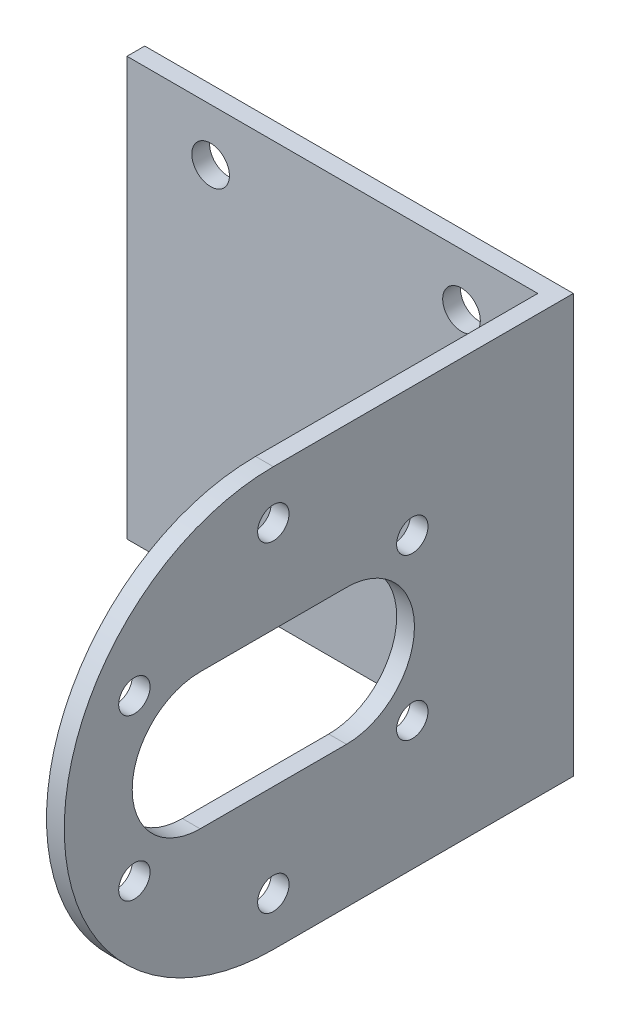
ISO-10303-21;
HEADER;
FILE_DESCRIPTION(('STEP AP214'),'2;1');
FILE_NAME('part.step','',(''),(''),'','','');
FILE_SCHEMA(('AUTOMOTIVE_DESIGN { 1 0 10303 214 1 1 1 1 }'));
ENDSEC;
DATA;
#1=APPLICATION_CONTEXT('core data for automotive mechanical design processes');
#2=APPLICATION_PROTOCOL_DEFINITION('international standard','automotive_design',2000,#1);
#3=PRODUCT_CONTEXT('',#1,'mechanical');
#4=PRODUCT('Part','Part','',(#3));
#5=PRODUCT_RELATED_PRODUCT_CATEGORY('part','',(#4));
#6=PRODUCT_DEFINITION_FORMATION('','',#4);
#7=PRODUCT_DEFINITION_CONTEXT('part definition',#1,'design');
#8=PRODUCT_DEFINITION('design','',#6,#7);
#9=PRODUCT_DEFINITION_SHAPE('','',#8);
#10=(LENGTH_UNIT() NAMED_UNIT(*) SI_UNIT(.MILLI.,.METRE.));
#11=(NAMED_UNIT(*) PLANE_ANGLE_UNIT() SI_UNIT($,.RADIAN.));
#12=(NAMED_UNIT(*) SI_UNIT($,.STERADIAN.) SOLID_ANGLE_UNIT());
#13=UNCERTAINTY_MEASURE_WITH_UNIT(LENGTH_MEASURE(1.E-05),#10,'distance_accuracy_value','');
#14=(GEOMETRIC_REPRESENTATION_CONTEXT(3) GLOBAL_UNCERTAINTY_ASSIGNED_CONTEXT((#13)) GLOBAL_UNIT_ASSIGNED_CONTEXT((#10,
#11,#12)) REPRESENTATION_CONTEXT('',''));
#15=CARTESIAN_POINT('',(0.,0.,0.));
#16=DIRECTION('',(0.,0.,1.));
#17=DIRECTION('',(1.,0.,0.));
#18=AXIS2_PLACEMENT_3D('',#15,#16,#17);
#19=CARTESIAN_POINT('',(41.,0.,1.7));
#20=DIRECTION('',(-1.,0.,0.));
#21=DIRECTION('',(0.,0.,1.));
#22=AXIS2_PLACEMENT_3D('',#19,#20,#21);
#23=PLANE('',#22);
#24=CARTESIAN_POINT('',(41.,12.3250000000001,15.4065100519088));
#25=DIRECTION('',(-1.,0.,0.));
#26=DIRECTION('',(0.,0.,1.));
#27=AXIS2_PLACEMENT_3D('',#24,#25,#26);
#28=CIRCLE('',#27,1.5);
#29=CARTESIAN_POINT('',(41.,12.3250000000001,16.9065100519088));
#30=VERTEX_POINT('',#29);
#31=EDGE_CURVE('E408',#30,#30,#28,.T.);
#32=ORIENTED_EDGE('',*,*,#31,.T.);
#33=EDGE_LOOP('',(#32));
#34=FACE_BOUND('',#33,.T.);
#35=CARTESIAN_POINT('',(41.,4.65,28.7));
#36=DIRECTION('',(-1.,0.,0.));
#37=DIRECTION('',(0.,0.,1.));
#38=AXIS2_PLACEMENT_3D('',#35,#36,#37);
#39=CIRCLE('',#38,1.5);
#40=CARTESIAN_POINT('',(41.,4.65,30.2));
#41=VERTEX_POINT('',#40);
#42=EDGE_CURVE('E404',#41,#41,#39,.T.);
#43=ORIENTED_EDGE('',*,*,#42,.T.);
#44=EDGE_LOOP('',(#43));
#45=FACE_BOUND('',#44,.T.);
#46=CARTESIAN_POINT('',(41.,12.325,41.9934899480911));
#47=DIRECTION('',(-1.,0.,0.));
#48=DIRECTION('',(0.,0.,1.));
#49=AXIS2_PLACEMENT_3D('',#46,#47,#48);
#50=CIRCLE('',#49,1.5);
#51=CARTESIAN_POINT('',(41.,12.325,43.4934899480911));
#52=VERTEX_POINT('',#51);
#53=EDGE_CURVE('E400',#52,#52,#50,.T.);
#54=ORIENTED_EDGE('',*,*,#53,.T.);
#55=EDGE_LOOP('',(#54));
#56=FACE_BOUND('',#55,.T.);
#57=CARTESIAN_POINT('',(41.,27.675,41.9934899480911));
#58=DIRECTION('',(-1.,0.,0.));
#59=DIRECTION('',(0.,0.,1.));
#60=AXIS2_PLACEMENT_3D('',#57,#58,#59);
#61=CIRCLE('',#60,1.5);
#62=CARTESIAN_POINT('',(41.,27.675,43.4934899480911));
#63=VERTEX_POINT('',#62);
#64=EDGE_CURVE('E396',#63,#63,#61,.T.);
#65=ORIENTED_EDGE('',*,*,#64,.T.);
#66=EDGE_LOOP('',(#65));
#67=FACE_BOUND('',#66,.T.);
#68=CARTESIAN_POINT('',(41.,35.35,28.7));
#69=DIRECTION('',(-1.,0.,0.));
#70=DIRECTION('',(0.,0.,1.));
#71=AXIS2_PLACEMENT_3D('',#68,#69,#70);
#72=CIRCLE('',#71,1.5);
#73=CARTESIAN_POINT('',(41.,35.35,30.2));
#74=VERTEX_POINT('',#73);
#75=EDGE_CURVE('E387',#74,#74,#72,.T.);
#76=ORIENTED_EDGE('',*,*,#75,.T.);
#77=EDGE_LOOP('',(#76));
#78=FACE_BOUND('',#77,.T.);
#79=CARTESIAN_POINT('',(41.,27.6749999999999,15.4065100519088));
#80=DIRECTION('',(-1.,0.,0.));
#81=DIRECTION('',(0.,0.,1.));
#82=AXIS2_PLACEMENT_3D('',#79,#80,#81);
#83=CIRCLE('',#82,1.5);
#84=CARTESIAN_POINT('',(41.,27.6749999999999,16.9065100519088));
#85=VERTEX_POINT('',#84);
#86=EDGE_CURVE('E382',#85,#85,#83,.T.);
#87=ORIENTED_EDGE('',*,*,#86,.T.);
#88=EDGE_LOOP('',(#87));
#89=FACE_BOUND('',#88,.T.);
#90=CARTESIAN_POINT('',(41.,20.,21.7));
#91=DIRECTION('',(-1.,0.,0.));
#92=DIRECTION('',(0.,0.,1.));
#93=AXIS2_PLACEMENT_3D('',#90,#91,#92);
#94=CIRCLE('',#93,6.5);
#95=CARTESIAN_POINT('',(41.,13.5,21.7));
#96=VERTEX_POINT('',#95);
#97=CARTESIAN_POINT('',(41.,26.5,21.7));
#98=VERTEX_POINT('',#97);
#99=EDGE_CURVE('E195',#96,#98,#94,.F.);
#100=ORIENTED_EDGE('',*,*,#99,.F.);
#101=DIRECTION('',(0.,0.,1.));
#102=VECTOR('',#101,1.);
#103=CARTESIAN_POINT('',(41.,13.5,1.7));
#104=LINE('',#103,#102);
#105=CARTESIAN_POINT('',(41.,13.5,35.7));
#106=VERTEX_POINT('',#105);
#107=EDGE_CURVE('E198',#96,#106,#104,.T.);
#108=ORIENTED_EDGE('',*,*,#107,.T.);
#109=CARTESIAN_POINT('',(41.,20.,35.7));
#110=DIRECTION('',(-1.,0.,0.));
#111=DIRECTION('',(0.,0.,1.));
#112=AXIS2_PLACEMENT_3D('',#109,#110,#111);
#113=CIRCLE('',#112,6.5);
#114=CARTESIAN_POINT('',(41.,26.5,35.7));
#115=VERTEX_POINT('',#114);
#116=EDGE_CURVE('E190',#106,#115,#113,.T.);
#117=ORIENTED_EDGE('',*,*,#116,.T.);
#118=DIRECTION('',(0.,0.,1.));
#119=VECTOR('',#118,1.);
#120=CARTESIAN_POINT('',(41.,26.5,1.7));
#121=LINE('',#120,#119);
#122=EDGE_CURVE('E147',#98,#115,#121,.T.);
#123=ORIENTED_EDGE('',*,*,#122,.F.);
#124=EDGE_LOOP('',(#100,#108,#117,#123));
#125=FACE_BOUND('',#124,.T.);
#126=CARTESIAN_POINT('',(41.,20.,28.7));
#127=DIRECTION('',(-1.,0.,0.));
#128=DIRECTION('',(0.,0.,1.));
#129=AXIS2_PLACEMENT_3D('',#126,#127,#128);
#130=CIRCLE('',#129,20.);
#131=CARTESIAN_POINT('',(41.,0.,28.7));
#132=VERTEX_POINT('',#131);
#133=CARTESIAN_POINT('',(41.,40.,28.7));
#134=VERTEX_POINT('',#133);
#135=EDGE_CURVE('E184',#132,#134,#130,.T.);
#136=ORIENTED_EDGE('',*,*,#135,.F.);
#137=DIRECTION('',(0.,0.,-1.));
#138=VECTOR('',#137,1.);
#139=CARTESIAN_POINT('',(41.,0.,1.7));
#140=LINE('',#139,#138);
#141=CARTESIAN_POINT('',(41.,0.,0.));
#142=VERTEX_POINT('',#141);
#143=EDGE_CURVE('E72',#132,#142,#140,.T.);
#144=ORIENTED_EDGE('',*,*,#143,.T.);
#145=DIRECTION('',(0.,1.,0.));
#146=VECTOR('',#145,1.);
#147=CARTESIAN_POINT('',(41.,0.,0.));
#148=LINE('',#147,#146);
#149=CARTESIAN_POINT('',(41.,40.,0.));
#150=VERTEX_POINT('',#149);
#151=EDGE_CURVE('E265',#142,#150,#148,.T.);
#152=ORIENTED_EDGE('',*,*,#151,.T.);
#153=DIRECTION('',(0.,0.,-1.));
#154=VECTOR('',#153,1.);
#155=CARTESIAN_POINT('',(41.,40.,1.7));
#156=LINE('',#155,#154);
#157=EDGE_CURVE('E274',#134,#150,#156,.T.);
#158=ORIENTED_EDGE('',*,*,#157,.F.);
#159=EDGE_LOOP('',(#136,#144,#152,#158));
#160=FACE_BOUND('',#159,.T.);
#161=ADVANCED_FACE('F63',(#34,#45,#56,#67,#78,#89,#125,#160),#23,.F.);
#162=CARTESIAN_POINT('',(0.,40.,1.7));
#163=DIRECTION('',(0.,-1.,0.));
#164=DIRECTION('',(0.,0.,-1.));
#165=AXIS2_PLACEMENT_3D('',#162,#163,#164);
#166=PLANE('',#165);
#167=DIRECTION('',(-1.,0.,0.));
#168=VECTOR('',#167,1.);
#169=CARTESIAN_POINT('',(49.3,40.,28.7));
#170=LINE('',#169,#168);
#171=CARTESIAN_POINT('',(39.3,40.,28.7));
#172=VERTEX_POINT('',#171);
#173=EDGE_CURVE('E181',#134,#172,#170,.T.);
#174=ORIENTED_EDGE('',*,*,#173,.F.);
#175=ORIENTED_EDGE('',*,*,#157,.T.);
#176=DIRECTION('',(-1.,0.,0.));
#177=VECTOR('',#176,1.);
#178=CARTESIAN_POINT('',(0.,40.,0.));
#179=LINE('',#178,#177);
#180=CARTESIAN_POINT('',(0.,40.,0.));
#181=VERTEX_POINT('',#180);
#182=EDGE_CURVE('E250',#150,#181,#179,.T.);
#183=ORIENTED_EDGE('',*,*,#182,.T.);
#184=DIRECTION('',(0.,0.,-1.));
#185=VECTOR('',#184,1.);
#186=CARTESIAN_POINT('',(0.,40.,1.7));
#187=LINE('',#186,#185);
#188=CARTESIAN_POINT('',(0.,40.,1.7));
#189=VERTEX_POINT('',#188);
#190=EDGE_CURVE('E257',#189,#181,#187,.T.);
#191=ORIENTED_EDGE('',*,*,#190,.F.);
#192=DIRECTION('',(-1.,0.,0.));
#193=VECTOR('',#192,1.);
#194=CARTESIAN_POINT('',(8.,40.,1.7));
#195=LINE('',#194,#193);
#196=CARTESIAN_POINT('',(39.3,40.,1.7));
#197=VERTEX_POINT('',#196);
#198=EDGE_CURVE('E254',#197,#189,#195,.T.);
#199=ORIENTED_EDGE('',*,*,#198,.F.);
#200=DIRECTION('',(0.,0.,-1.));
#201=VECTOR('',#200,1.);
#202=CARTESIAN_POINT('',(39.3,40.,61.7));
#203=LINE('',#202,#201);
#204=EDGE_CURVE('E209',#172,#197,#203,.T.);
#205=ORIENTED_EDGE('',*,*,#204,.F.);
#206=EDGE_LOOP('',(#174,#175,#183,#191,#199,#205));
#207=FACE_BOUND('',#206,.T.);
#208=ADVANCED_FACE('F293',(#207),#166,.F.);
#209=CARTESIAN_POINT('',(39.3,0.,61.7));
#210=DIRECTION('',(1.,0.,0.));
#211=DIRECTION('',(0.,0.,-1.));
#212=AXIS2_PLACEMENT_3D('',#209,#210,#211);
#213=PLANE('',#212);
#214=CARTESIAN_POINT('',(39.3,12.3250000000001,15.4065100519088));
#215=DIRECTION('',(-1.,0.,0.));
#216=DIRECTION('',(0.,0.,1.));
#217=AXIS2_PLACEMENT_3D('',#214,#215,#216);
#218=CIRCLE('',#217,1.5);
#219=CARTESIAN_POINT('',(39.3,12.3250000000001,16.9065100519088));
#220=VERTEX_POINT('',#219);
#221=EDGE_CURVE('E360',#220,#220,#218,.T.);
#222=ORIENTED_EDGE('',*,*,#221,.F.);
#223=EDGE_LOOP('',(#222));
#224=FACE_BOUND('',#223,.T.);
#225=CARTESIAN_POINT('',(39.3,4.65,28.7));
#226=DIRECTION('',(-1.,0.,0.));
#227=DIRECTION('',(0.,0.,1.));
#228=AXIS2_PLACEMENT_3D('',#225,#226,#227);
#229=CIRCLE('',#228,1.5);
#230=CARTESIAN_POINT('',(39.3,4.65,30.2));
#231=VERTEX_POINT('',#230);
#232=EDGE_CURVE('E364',#231,#231,#229,.T.);
#233=ORIENTED_EDGE('',*,*,#232,.F.);
#234=EDGE_LOOP('',(#233));
#235=FACE_BOUND('',#234,.T.);
#236=CARTESIAN_POINT('',(39.3,12.325,41.9934899480911));
#237=DIRECTION('',(-1.,0.,0.));
#238=DIRECTION('',(0.,0.,1.));
#239=AXIS2_PLACEMENT_3D('',#236,#237,#238);
#240=CIRCLE('',#239,1.5);
#241=CARTESIAN_POINT('',(39.3,12.325,43.4934899480911));
#242=VERTEX_POINT('',#241);
#243=EDGE_CURVE('E368',#242,#242,#240,.T.);
#244=ORIENTED_EDGE('',*,*,#243,.F.);
#245=EDGE_LOOP('',(#244));
#246=FACE_BOUND('',#245,.T.);
#247=CARTESIAN_POINT('',(39.3,27.675,41.9934899480911));
#248=DIRECTION('',(-1.,0.,0.));
#249=DIRECTION('',(0.,0.,1.));
#250=AXIS2_PLACEMENT_3D('',#247,#248,#249);
#251=CIRCLE('',#250,1.5);
#252=CARTESIAN_POINT('',(39.3,27.675,43.4934899480911));
#253=VERTEX_POINT('',#252);
#254=EDGE_CURVE('E372',#253,#253,#251,.T.);
#255=ORIENTED_EDGE('',*,*,#254,.F.);
#256=EDGE_LOOP('',(#255));
#257=FACE_BOUND('',#256,.T.);
#258=CARTESIAN_POINT('',(39.3,35.35,28.7));
#259=DIRECTION('',(-1.,0.,0.));
#260=DIRECTION('',(0.,0.,1.));
#261=AXIS2_PLACEMENT_3D('',#258,#259,#260);
#262=CIRCLE('',#261,1.5);
#263=CARTESIAN_POINT('',(39.3,35.35,30.2));
#264=VERTEX_POINT('',#263);
#265=EDGE_CURVE('E376',#264,#264,#262,.T.);
#266=ORIENTED_EDGE('',*,*,#265,.F.);
#267=EDGE_LOOP('',(#266));
#268=FACE_BOUND('',#267,.T.);
#269=CARTESIAN_POINT('',(39.3,27.6749999999999,15.4065100519088));
#270=DIRECTION('',(-1.,0.,0.));
#271=DIRECTION('',(0.,0.,1.));
#272=AXIS2_PLACEMENT_3D('',#269,#270,#271);
#273=CIRCLE('',#272,1.5);
#274=CARTESIAN_POINT('',(39.3,27.6749999999999,16.9065100519088));
#275=VERTEX_POINT('',#274);
#276=EDGE_CURVE('E379',#275,#275,#273,.T.);
#277=ORIENTED_EDGE('',*,*,#276,.F.);
#278=EDGE_LOOP('',(#277));
#279=FACE_BOUND('',#278,.T.);
#280=CARTESIAN_POINT('',(39.3,20.,35.7));
#281=DIRECTION('',(-1.,0.,0.));
#282=DIRECTION('',(0.,0.,1.));
#283=AXIS2_PLACEMENT_3D('',#280,#281,#282);
#284=CIRCLE('',#283,6.5);
#285=CARTESIAN_POINT('',(39.3,13.5,35.7));
#286=VERTEX_POINT('',#285);
#287=CARTESIAN_POINT('',(39.3,26.5,35.7));
#288=VERTEX_POINT('',#287);
#289=EDGE_CURVE('E154',#286,#288,#284,.T.);
#290=ORIENTED_EDGE('',*,*,#289,.F.);
#291=DIRECTION('',(0.,0.,1.));
#292=VECTOR('',#291,1.);
#293=CARTESIAN_POINT('',(39.3,13.5,0.));
#294=LINE('',#293,#292);
#295=CARTESIAN_POINT('',(39.3,13.5,21.7));
#296=VERTEX_POINT('',#295);
#297=EDGE_CURVE('E87',#296,#286,#294,.T.);
#298=ORIENTED_EDGE('',*,*,#297,.F.);
#299=CARTESIAN_POINT('',(39.3,20.,21.7));
#300=DIRECTION('',(-1.,0.,0.));
#301=DIRECTION('',(0.,0.,1.));
#302=AXIS2_PLACEMENT_3D('',#299,#300,#301);
#303=CIRCLE('',#302,6.5);
#304=CARTESIAN_POINT('',(39.3,26.5,21.7));
#305=VERTEX_POINT('',#304);
#306=EDGE_CURVE('E162',#296,#305,#303,.F.);
#307=ORIENTED_EDGE('',*,*,#306,.T.);
#308=DIRECTION('',(0.,0.,1.));
#309=VECTOR('',#308,1.);
#310=CARTESIAN_POINT('',(39.3,26.5,0.));
#311=LINE('',#310,#309);
#312=EDGE_CURVE('E144',#305,#288,#311,.T.);
#313=ORIENTED_EDGE('',*,*,#312,.T.);
#314=EDGE_LOOP('',(#290,#298,#307,#313));
#315=FACE_BOUND('',#314,.T.);
#316=CARTESIAN_POINT('',(39.3,20.,28.7));
#317=DIRECTION('',(-1.,0.,0.));
#318=DIRECTION('',(0.,0.,1.));
#319=AXIS2_PLACEMENT_3D('',#316,#317,#318);
#320=CIRCLE('',#319,20.);
#321=CARTESIAN_POINT('',(39.3,0.,28.7));
#322=VERTEX_POINT('',#321);
#323=EDGE_CURVE('E172',#322,#172,#320,.T.);
#324=ORIENTED_EDGE('',*,*,#323,.T.);
#325=ORIENTED_EDGE('',*,*,#204,.T.);
#326=DIRECTION('',(0.,-1.,0.));
#327=VECTOR('',#326,1.);
#328=CARTESIAN_POINT('',(39.3,0.,1.7));
#329=LINE('',#328,#327);
#330=CARTESIAN_POINT('',(39.3,0.,1.7));
#331=VERTEX_POINT('',#330);
#332=EDGE_CURVE('E202',#197,#331,#329,.T.);
#333=ORIENTED_EDGE('',*,*,#332,.T.);
#334=DIRECTION('',(0.,0.,-1.));
#335=VECTOR('',#334,1.);
#336=CARTESIAN_POINT('',(39.3,0.,61.7));
#337=LINE('',#336,#335);
#338=EDGE_CURVE('E206',#322,#331,#337,.T.);
#339=ORIENTED_EDGE('',*,*,#338,.F.);
#340=EDGE_LOOP('',(#324,#325,#333,#339));
#341=FACE_BOUND('',#340,.T.);
#342=ADVANCED_FACE('F159',(#224,#235,#246,#257,#268,#279,#315,#341),#213,.F.);
#343=CARTESIAN_POINT('',(0.,0.,1.7));
#344=DIRECTION('',(0.,0.,-1.));
#345=DIRECTION('',(-1.,0.,0.));
#346=AXIS2_PLACEMENT_3D('',#343,#344,#345);
#347=PLANE('',#346);
#348=CARTESIAN_POINT('',(32.,35.,1.7));
#349=DIRECTION('',(0.,0.,1.));
#350=DIRECTION('',(1.,0.,0.));
#351=AXIS2_PLACEMENT_3D('',#348,#349,#350);
#352=CIRCLE('',#351,1.8);
#353=CARTESIAN_POINT('',(33.8,35.,1.7));
#354=VERTEX_POINT('',#353);
#355=EDGE_CURVE('E213',#354,#354,#352,.T.);
#356=ORIENTED_EDGE('',*,*,#355,.F.);
#357=EDGE_LOOP('',(#356));
#358=FACE_BOUND('',#357,.T.);
#359=CARTESIAN_POINT('',(32.,5.,1.7));
#360=DIRECTION('',(0.,0.,1.));
#361=DIRECTION('',(1.,0.,0.));
#362=AXIS2_PLACEMENT_3D('',#359,#360,#361);
#363=CIRCLE('',#362,1.8);
#364=CARTESIAN_POINT('',(33.8,5.,1.7));
#365=VERTEX_POINT('',#364);
#366=EDGE_CURVE('E221',#365,#365,#363,.T.);
#367=ORIENTED_EDGE('',*,*,#366,.F.);
#368=EDGE_LOOP('',(#367));
#369=FACE_BOUND('',#368,.T.);
#370=CARTESIAN_POINT('',(8.,35.,1.7));
#371=DIRECTION('',(0.,0.,1.));
#372=DIRECTION('',(1.,0.,0.));
#373=AXIS2_PLACEMENT_3D('',#370,#371,#372);
#374=CIRCLE('',#373,1.8);
#375=CARTESIAN_POINT('',(9.8,35.,1.7));
#376=VERTEX_POINT('',#375);
#377=EDGE_CURVE('E229',#376,#376,#374,.T.);
#378=ORIENTED_EDGE('',*,*,#377,.F.);
#379=EDGE_LOOP('',(#378));
#380=FACE_BOUND('',#379,.T.);
#381=CARTESIAN_POINT('',(8.,5.,1.7));
#382=DIRECTION('',(0.,0.,1.));
#383=DIRECTION('',(1.,0.,0.));
#384=AXIS2_PLACEMENT_3D('',#381,#382,#383);
#385=CIRCLE('',#384,1.8);
#386=CARTESIAN_POINT('',(9.8,5.,1.7));
#387=VERTEX_POINT('',#386);
#388=EDGE_CURVE('E237',#387,#387,#385,.T.);
#389=ORIENTED_EDGE('',*,*,#388,.F.);
#390=EDGE_LOOP('',(#389));
#391=FACE_BOUND('',#390,.T.);
#392=ORIENTED_EDGE('',*,*,#332,.F.);
#393=ORIENTED_EDGE('',*,*,#198,.T.);
#394=DIRECTION('',(0.,-1.,0.));
#395=VECTOR('',#394,1.);
#396=CARTESIAN_POINT('',(0.,0.,1.7));
#397=LINE('',#396,#395);
#398=CARTESIAN_POINT('',(0.,0.,1.7));
#399=VERTEX_POINT('',#398);
#400=EDGE_CURVE('E245',#189,#399,#397,.T.);
#401=ORIENTED_EDGE('',*,*,#400,.T.);
#402=DIRECTION('',(1.,0.,0.));
#403=VECTOR('',#402,1.);
#404=CARTESIAN_POINT('',(0.,0.,1.7));
#405=LINE('',#404,#403);
#406=EDGE_CURVE('E249',#399,#331,#405,.T.);
#407=ORIENTED_EDGE('',*,*,#406,.T.);
#408=EDGE_LOOP('',(#392,#393,#401,#407));
#409=FACE_BOUND('',#408,.T.);
#410=ADVANCED_FACE('F299',(#358,#369,#380,#391,#409),#347,.F.);
#411=CARTESIAN_POINT('',(0.,0.,0.));
#412=DIRECTION('',(0.,0.,-1.));
#413=DIRECTION('',(-1.,0.,0.));
#414=AXIS2_PLACEMENT_3D('',#411,#412,#413);
#415=PLANE('',#414);
#416=CARTESIAN_POINT('',(32.,5.,0.));
#417=DIRECTION('',(0.,0.,1.));
#418=DIRECTION('',(1.,0.,0.));
#419=AXIS2_PLACEMENT_3D('',#416,#417,#418);
#420=CIRCLE('',#419,1.8);
#421=CARTESIAN_POINT('',(33.8,5.,0.));
#422=VERTEX_POINT('',#421);
#423=EDGE_CURVE('E217',#422,#422,#420,.T.);
#424=ORIENTED_EDGE('',*,*,#423,.T.);
#425=EDGE_LOOP('',(#424));
#426=FACE_BOUND('',#425,.T.);
#427=CARTESIAN_POINT('',(8.,5.,0.));
#428=DIRECTION('',(0.,0.,1.));
#429=DIRECTION('',(1.,0.,0.));
#430=AXIS2_PLACEMENT_3D('',#427,#428,#429);
#431=CIRCLE('',#430,1.8);
#432=CARTESIAN_POINT('',(9.8,5.,0.));
#433=VERTEX_POINT('',#432);
#434=EDGE_CURVE('E233',#433,#433,#431,.T.);
#435=ORIENTED_EDGE('',*,*,#434,.T.);
#436=EDGE_LOOP('',(#435));
#437=FACE_BOUND('',#436,.T.);
#438=DIRECTION('',(0.,-1.,0.));
#439=VECTOR('',#438,1.);
#440=CARTESIAN_POINT('',(0.,0.,0.));
#441=LINE('',#440,#439);
#442=CARTESIAN_POINT('',(0.,0.,0.));
#443=VERTEX_POINT('',#442);
#444=EDGE_CURVE('E241',#181,#443,#441,.T.);
#445=ORIENTED_EDGE('',*,*,#444,.F.);
#446=ORIENTED_EDGE('',*,*,#182,.F.);
#447=ORIENTED_EDGE('',*,*,#151,.F.);
#448=DIRECTION('',(1.,0.,0.));
#449=VECTOR('',#448,1.);
#450=CARTESIAN_POINT('',(41.,0.,0.));
#451=LINE('',#450,#449);
#452=EDGE_CURVE('E261',#443,#142,#451,.T.);
#453=ORIENTED_EDGE('',*,*,#452,.F.);
#454=EDGE_LOOP('',(#445,#446,#447,#453));
#455=FACE_BOUND('',#454,.T.);
#456=CARTESIAN_POINT('',(8.,35.,0.));
#457=DIRECTION('',(0.,0.,1.));
#458=DIRECTION('',(1.,0.,0.));
#459=AXIS2_PLACEMENT_3D('',#456,#457,#458);
#460=CIRCLE('',#459,1.8);
#461=CARTESIAN_POINT('',(9.8,35.,0.));
#462=VERTEX_POINT('',#461);
#463=EDGE_CURVE('E225',#462,#462,#460,.T.);
#464=ORIENTED_EDGE('',*,*,#463,.T.);
#465=EDGE_LOOP('',(#464));
#466=FACE_BOUND('',#465,.T.);
#467=CARTESIAN_POINT('',(32.,35.,0.));
#468=DIRECTION('',(0.,0.,1.));
#469=DIRECTION('',(1.,0.,0.));
#470=AXIS2_PLACEMENT_3D('',#467,#468,#469);
#471=CIRCLE('',#470,1.8);
#472=CARTESIAN_POINT('',(33.8,35.,0.));
#473=VERTEX_POINT('',#472);
#474=EDGE_CURVE('E212',#473,#473,#471,.T.);
#475=ORIENTED_EDGE('',*,*,#474,.T.);
#476=EDGE_LOOP('',(#475));
#477=FACE_BOUND('',#476,.T.);
#478=ADVANCED_FACE('F288',(#426,#437,#455,#466,#477),#415,.T.);
#479=CARTESIAN_POINT('',(0.,0.,1.7));
#480=DIRECTION('',(1.,0.,0.));
#481=DIRECTION('',(0.,0.,-1.));
#482=AXIS2_PLACEMENT_3D('',#479,#480,#481);
#483=PLANE('',#482);
#484=ORIENTED_EDGE('',*,*,#444,.T.);
#485=DIRECTION('',(0.,0.,-1.));
#486=VECTOR('',#485,1.);
#487=CARTESIAN_POINT('',(0.,0.,1.7));
#488=LINE('',#487,#486);
#489=EDGE_CURVE('E12',#399,#443,#488,.T.);
#490=ORIENTED_EDGE('',*,*,#489,.F.);
#491=ORIENTED_EDGE('',*,*,#400,.F.);
#492=ORIENTED_EDGE('',*,*,#190,.T.);
#493=EDGE_LOOP('',(#484,#490,#491,#492));
#494=FACE_BOUND('',#493,.T.);
#495=ADVANCED_FACE('F65',(#494),#483,.F.);
#496=CARTESIAN_POINT('',(41.,0.,1.7));
#497=DIRECTION('',(0.,1.,0.));
#498=DIRECTION('',(0.,0.,1.));
#499=AXIS2_PLACEMENT_3D('',#496,#497,#498);
#500=PLANE('',#499);
#501=ORIENTED_EDGE('',*,*,#143,.F.);
#502=DIRECTION('',(-1.,0.,0.));
#503=VECTOR('',#502,1.);
#504=CARTESIAN_POINT('',(49.3,0.,28.7));
#505=LINE('',#504,#503);
#506=EDGE_CURVE('E180',#132,#322,#505,.T.);
#507=ORIENTED_EDGE('',*,*,#506,.T.);
#508=ORIENTED_EDGE('',*,*,#338,.T.);
#509=ORIENTED_EDGE('',*,*,#406,.F.);
#510=ORIENTED_EDGE('',*,*,#489,.T.);
#511=ORIENTED_EDGE('',*,*,#452,.T.);
#512=EDGE_LOOP('',(#501,#507,#508,#509,#510,#511));
#513=FACE_BOUND('',#512,.T.);
#514=ADVANCED_FACE('F283',(#513),#500,.F.);
#515=CARTESIAN_POINT('',(8.,5.,1.7));
#516=DIRECTION('',(0.,0.,-1.));
#517=DIRECTION('',(-1.,0.,0.));
#518=AXIS2_PLACEMENT_3D('',#515,#516,#517);
#519=CYLINDRICAL_SURFACE('',#518,1.8);
#520=ORIENTED_EDGE('',*,*,#388,.T.);
#521=EDGE_LOOP('',(#520));
#522=FACE_BOUND('',#521,.T.);
#523=ORIENTED_EDGE('',*,*,#434,.F.);
#524=EDGE_LOOP('',(#523));
#525=FACE_BOUND('',#524,.T.);
#526=ADVANCED_FACE('F329',(#522,#525),#519,.F.);
#527=CARTESIAN_POINT('',(8.,35.,1.7));
#528=DIRECTION('',(0.,0.,-1.));
#529=DIRECTION('',(-1.,0.,0.));
#530=AXIS2_PLACEMENT_3D('',#527,#528,#529);
#531=CYLINDRICAL_SURFACE('',#530,1.8);
#532=ORIENTED_EDGE('',*,*,#377,.T.);
#533=EDGE_LOOP('',(#532));
#534=FACE_BOUND('',#533,.T.);
#535=ORIENTED_EDGE('',*,*,#463,.F.);
#536=EDGE_LOOP('',(#535));
#537=FACE_BOUND('',#536,.T.);
#538=ADVANCED_FACE('F334',(#534,#537),#531,.F.);
#539=CARTESIAN_POINT('',(32.,5.,1.7));
#540=DIRECTION('',(0.,0.,-1.));
#541=DIRECTION('',(-1.,0.,0.));
#542=AXIS2_PLACEMENT_3D('',#539,#540,#541);
#543=CYLINDRICAL_SURFACE('',#542,1.8);
#544=ORIENTED_EDGE('',*,*,#366,.T.);
#545=EDGE_LOOP('',(#544));
#546=FACE_BOUND('',#545,.T.);
#547=ORIENTED_EDGE('',*,*,#423,.F.);
#548=EDGE_LOOP('',(#547));
#549=FACE_BOUND('',#548,.T.);
#550=ADVANCED_FACE('F314',(#546,#549),#543,.F.);
#551=CARTESIAN_POINT('',(32.,35.,1.7));
#552=DIRECTION('',(0.,0.,-1.));
#553=DIRECTION('',(-1.,0.,0.));
#554=AXIS2_PLACEMENT_3D('',#551,#552,#553);
#555=CYLINDRICAL_SURFACE('',#554,1.8);
#556=ORIENTED_EDGE('',*,*,#355,.T.);
#557=EDGE_LOOP('',(#556));
#558=FACE_BOUND('',#557,.T.);
#559=ORIENTED_EDGE('',*,*,#474,.F.);
#560=EDGE_LOOP('',(#559));
#561=FACE_BOUND('',#560,.T.);
#562=ADVANCED_FACE('F306',(#558,#561),#555,.F.);
#563=CARTESIAN_POINT('',(49.3,20.,28.7));
#564=DIRECTION('',(-1.,0.,0.));
#565=DIRECTION('',(0.,0.,1.));
#566=AXIS2_PLACEMENT_3D('',#563,#564,#565);
#567=CYLINDRICAL_SURFACE('',#566,20.);
#568=ORIENTED_EDGE('',*,*,#135,.T.);
#569=ORIENTED_EDGE('',*,*,#173,.T.);
#570=ORIENTED_EDGE('',*,*,#323,.F.);
#571=ORIENTED_EDGE('',*,*,#506,.F.);
#572=EDGE_LOOP('',(#568,#569,#570,#571));
#573=FACE_BOUND('',#572,.T.);
#574=ADVANCED_FACE('F303',(#573),#567,.T.);
#575=CARTESIAN_POINT('',(49.3,13.5,0.));
#576=DIRECTION('',(0.,-1.,0.));
#577=DIRECTION('',(0.,0.,-1.));
#578=AXIS2_PLACEMENT_3D('',#575,#576,#577);
#579=PLANE('',#578);
#580=DIRECTION('',(-1.,0.,0.));
#581=VECTOR('',#580,1.);
#582=CARTESIAN_POINT('',(49.3,13.5,21.7));
#583=LINE('',#582,#581);
#584=EDGE_CURVE('E169',#96,#296,#583,.T.);
#585=ORIENTED_EDGE('',*,*,#584,.T.);
#586=ORIENTED_EDGE('',*,*,#297,.T.);
#587=DIRECTION('',(-1.,0.,0.));
#588=VECTOR('',#587,1.);
#589=CARTESIAN_POINT('',(49.3,13.5,35.7));
#590=LINE('',#589,#588);
#591=EDGE_CURVE('E151',#106,#286,#590,.T.);
#592=ORIENTED_EDGE('',*,*,#591,.F.);
#593=ORIENTED_EDGE('',*,*,#107,.F.);
#594=EDGE_LOOP('',(#585,#586,#592,#593));
#595=FACE_BOUND('',#594,.T.);
#596=ADVANCED_FACE('F305',(#595),#579,.F.);
#597=CARTESIAN_POINT('',(49.3,20.,21.7));
#598=DIRECTION('',(-1.,0.,0.));
#599=DIRECTION('',(0.,0.,1.));
#600=AXIS2_PLACEMENT_3D('',#597,#598,#599);
#601=CYLINDRICAL_SURFACE('',#600,6.5);
#602=ORIENTED_EDGE('',*,*,#99,.T.);
#603=DIRECTION('',(-1.,0.,0.));
#604=VECTOR('',#603,1.);
#605=CARTESIAN_POINT('',(49.3,26.5,21.7));
#606=LINE('',#605,#604);
#607=EDGE_CURVE('E150',#98,#305,#606,.T.);
#608=ORIENTED_EDGE('',*,*,#607,.T.);
#609=ORIENTED_EDGE('',*,*,#306,.F.);
#610=ORIENTED_EDGE('',*,*,#584,.F.);
#611=EDGE_LOOP('',(#602,#608,#609,#610));
#612=FACE_BOUND('',#611,.T.);
#613=ADVANCED_FACE('F312',(#612),#601,.F.);
#614=CARTESIAN_POINT('',(49.3,26.5,0.));
#615=DIRECTION('',(0.,-1.,0.));
#616=DIRECTION('',(0.,0.,-1.));
#617=AXIS2_PLACEMENT_3D('',#614,#615,#616);
#618=PLANE('',#617);
#619=ORIENTED_EDGE('',*,*,#122,.T.);
#620=DIRECTION('',(-1.,0.,0.));
#621=VECTOR('',#620,1.);
#622=CARTESIAN_POINT('',(49.3,26.5,35.7));
#623=LINE('',#622,#621);
#624=EDGE_CURVE('E79',#115,#288,#623,.T.);
#625=ORIENTED_EDGE('',*,*,#624,.T.);
#626=ORIENTED_EDGE('',*,*,#312,.F.);
#627=ORIENTED_EDGE('',*,*,#607,.F.);
#628=EDGE_LOOP('',(#619,#625,#626,#627));
#629=FACE_BOUND('',#628,.T.);
#630=ADVANCED_FACE('F141',(#629),#618,.T.);
#631=CARTESIAN_POINT('',(49.3,20.,35.7));
#632=DIRECTION('',(-1.,0.,0.));
#633=DIRECTION('',(0.,0.,1.));
#634=AXIS2_PLACEMENT_3D('',#631,#632,#633);
#635=CYLINDRICAL_SURFACE('',#634,6.5);
#636=ORIENTED_EDGE('',*,*,#591,.T.);
#637=ORIENTED_EDGE('',*,*,#289,.T.);
#638=ORIENTED_EDGE('',*,*,#624,.F.);
#639=ORIENTED_EDGE('',*,*,#116,.F.);
#640=EDGE_LOOP('',(#636,#637,#638,#639));
#641=FACE_BOUND('',#640,.T.);
#642=ADVANCED_FACE('F155',(#641),#635,.F.);
#643=CARTESIAN_POINT('',(49.3,27.6749999999999,15.4065100519088));
#644=DIRECTION('',(-1.,0.,0.));
#645=DIRECTION('',(0.,0.,1.));
#646=AXIS2_PLACEMENT_3D('',#643,#644,#645);
#647=CYLINDRICAL_SURFACE('',#646,1.5);
#648=ORIENTED_EDGE('',*,*,#276,.T.);
#649=EDGE_LOOP('',(#648));
#650=FACE_BOUND('',#649,.T.);
#651=ORIENTED_EDGE('',*,*,#86,.F.);
#652=EDGE_LOOP('',(#651));
#653=FACE_BOUND('',#652,.T.);
#654=ADVANCED_FACE('F426',(#650,#653),#647,.F.);
#655=CARTESIAN_POINT('',(49.3,35.35,28.7));
#656=DIRECTION('',(-1.,0.,0.));
#657=DIRECTION('',(0.,0.,1.));
#658=AXIS2_PLACEMENT_3D('',#655,#656,#657);
#659=CYLINDRICAL_SURFACE('',#658,1.5);
#660=ORIENTED_EDGE('',*,*,#265,.T.);
#661=EDGE_LOOP('',(#660));
#662=FACE_BOUND('',#661,.T.);
#663=ORIENTED_EDGE('',*,*,#75,.F.);
#664=EDGE_LOOP('',(#663));
#665=FACE_BOUND('',#664,.T.);
#666=ADVANCED_FACE('F429',(#662,#665),#659,.F.);
#667=CARTESIAN_POINT('',(49.3,27.675,41.9934899480911));
#668=DIRECTION('',(-1.,0.,0.));
#669=DIRECTION('',(0.,0.,1.));
#670=AXIS2_PLACEMENT_3D('',#667,#668,#669);
#671=CYLINDRICAL_SURFACE('',#670,1.5);
#672=ORIENTED_EDGE('',*,*,#254,.T.);
#673=EDGE_LOOP('',(#672));
#674=FACE_BOUND('',#673,.T.);
#675=ORIENTED_EDGE('',*,*,#64,.F.);
#676=EDGE_LOOP('',(#675));
#677=FACE_BOUND('',#676,.T.);
#678=ADVANCED_FACE('F450',(#674,#677),#671,.F.);
#679=CARTESIAN_POINT('',(49.3,12.325,41.9934899480911));
#680=DIRECTION('',(-1.,0.,0.));
#681=DIRECTION('',(0.,0.,1.));
#682=AXIS2_PLACEMENT_3D('',#679,#680,#681);
#683=CYLINDRICAL_SURFACE('',#682,1.5);
#684=ORIENTED_EDGE('',*,*,#243,.T.);
#685=EDGE_LOOP('',(#684));
#686=FACE_BOUND('',#685,.T.);
#687=ORIENTED_EDGE('',*,*,#53,.F.);
#688=EDGE_LOOP('',(#687));
#689=FACE_BOUND('',#688,.T.);
#690=ADVANCED_FACE('F421',(#686,#689),#683,.F.);
#691=CARTESIAN_POINT('',(49.3,4.65,28.7));
#692=DIRECTION('',(-1.,0.,0.));
#693=DIRECTION('',(0.,0.,1.));
#694=AXIS2_PLACEMENT_3D('',#691,#692,#693);
#695=CYLINDRICAL_SURFACE('',#694,1.5);
#696=ORIENTED_EDGE('',*,*,#232,.T.);
#697=EDGE_LOOP('',(#696));
#698=FACE_BOUND('',#697,.T.);
#699=ORIENTED_EDGE('',*,*,#42,.F.);
#700=EDGE_LOOP('',(#699));
#701=FACE_BOUND('',#700,.T.);
#702=ADVANCED_FACE('F415',(#698,#701),#695,.F.);
#703=CARTESIAN_POINT('',(49.3,12.3250000000001,15.4065100519088));
#704=DIRECTION('',(-1.,0.,0.));
#705=DIRECTION('',(0.,0.,1.));
#706=AXIS2_PLACEMENT_3D('',#703,#704,#705);
#707=CYLINDRICAL_SURFACE('',#706,1.5);
#708=ORIENTED_EDGE('',*,*,#221,.T.);
#709=EDGE_LOOP('',(#708));
#710=FACE_BOUND('',#709,.T.);
#711=ORIENTED_EDGE('',*,*,#31,.F.);
#712=EDGE_LOOP('',(#711));
#713=FACE_BOUND('',#712,.T.);
#714=ADVANCED_FACE('F413',(#710,#713),#707,.F.);
#715=CLOSED_SHELL('',(#161,#208,#342,#410,#478,#495,#514,#526,#538,#550,#562,#574,#596,#613,
#630,#642,#654,#666,#678,#690,#702,#714));
#716=MANIFOLD_SOLID_BREP('B2',#715);
#717=ADVANCED_BREP_SHAPE_REPRESENTATION('',(#18,#716),#14);
#718=SHAPE_DEFINITION_REPRESENTATION(#9,#717);
ENDSEC;
END-ISO-10303-21;
